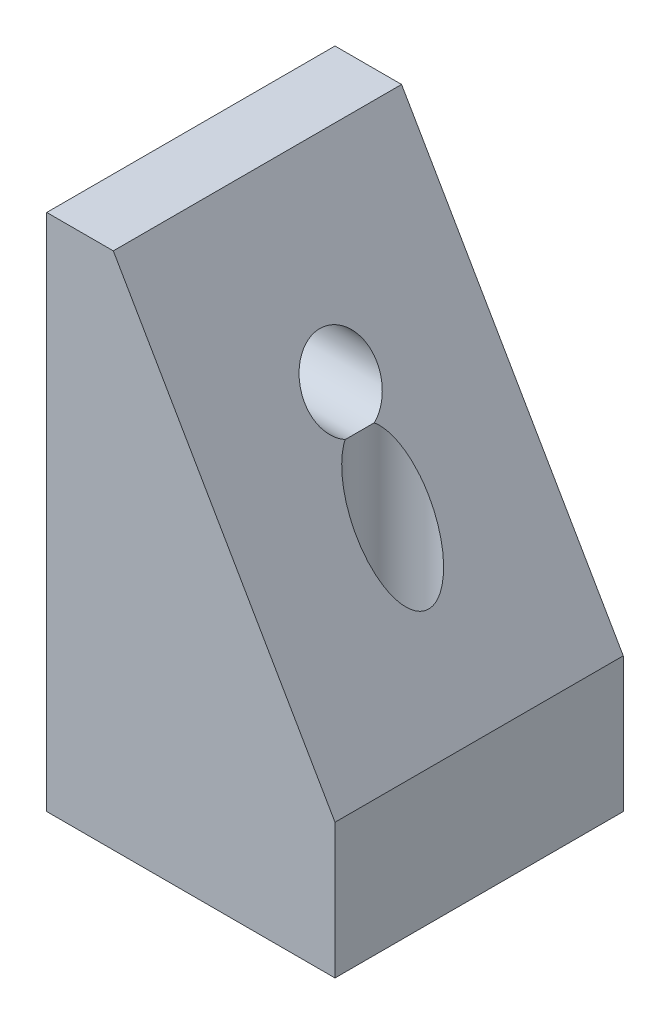
ISO-10303-21;
HEADER;
FILE_DESCRIPTION(('STEP AP214'),'2;1');
FILE_NAME('part.step','',(''),(''),'','','');
FILE_SCHEMA(('AUTOMOTIVE_DESIGN { 1 0 10303 214 1 1 1 1 }'));
ENDSEC;
DATA;
#1=APPLICATION_CONTEXT('core data for automotive mechanical design processes');
#2=APPLICATION_PROTOCOL_DEFINITION('international standard','automotive_design',2000,#1);
#3=PRODUCT_CONTEXT('',#1,'mechanical');
#4=PRODUCT('Part','Part','',(#3));
#5=PRODUCT_RELATED_PRODUCT_CATEGORY('part','',(#4));
#6=PRODUCT_DEFINITION_FORMATION('','',#4);
#7=PRODUCT_DEFINITION_CONTEXT('part definition',#1,'design');
#8=PRODUCT_DEFINITION('design','',#6,#7);
#9=PRODUCT_DEFINITION_SHAPE('','',#8);
#10=(LENGTH_UNIT() NAMED_UNIT(*) SI_UNIT(.MILLI.,.METRE.));
#11=(NAMED_UNIT(*) PLANE_ANGLE_UNIT() SI_UNIT($,.RADIAN.));
#12=(NAMED_UNIT(*) SI_UNIT($,.STERADIAN.) SOLID_ANGLE_UNIT());
#13=UNCERTAINTY_MEASURE_WITH_UNIT(LENGTH_MEASURE(1.E-05),#10,'distance_accuracy_value','');
#14=(GEOMETRIC_REPRESENTATION_CONTEXT(3) GLOBAL_UNCERTAINTY_ASSIGNED_CONTEXT((#13)) GLOBAL_UNIT_ASSIGNED_CONTEXT((#10,
#11,#12)) REPRESENTATION_CONTEXT('',''));
#15=CARTESIAN_POINT('',(0.,0.,0.));
#16=DIRECTION('',(0.,0.,1.));
#17=DIRECTION('',(1.,0.,0.));
#18=AXIS2_PLACEMENT_3D('',#15,#16,#17);
#19=CARTESIAN_POINT('',(0.,0.,10.));
#20=DIRECTION('',(1.,0.,0.));
#21=DIRECTION('',(0.,0.,-1.));
#22=AXIS2_PLACEMENT_3D('',#19,#20,#21);
#23=PLANE('',#22);
#24=DIRECTION('',(0.,-1.,0.));
#25=VECTOR('',#24,1.);
#26=CARTESIAN_POINT('',(0.,0.,0.));
#27=LINE('',#26,#25);
#28=CARTESIAN_POINT('',(0.,18.,0.));
#29=VERTEX_POINT('',#28);
#30=CARTESIAN_POINT('',(0.,0.,0.));
#31=VERTEX_POINT('',#30);
#32=EDGE_CURVE('E77',#29,#31,#27,.T.);
#33=ORIENTED_EDGE('',*,*,#32,.T.);
#34=DIRECTION('',(0.,0.,-1.));
#35=VECTOR('',#34,1.);
#36=CARTESIAN_POINT('',(0.,0.,10.));
#37=LINE('',#36,#35);
#38=CARTESIAN_POINT('',(0.,0.,10.));
#39=VERTEX_POINT('',#38);
#40=EDGE_CURVE('E112',#39,#31,#37,.T.);
#41=ORIENTED_EDGE('',*,*,#40,.F.);
#42=DIRECTION('',(0.,-1.,0.));
#43=VECTOR('',#42,1.);
#44=CARTESIAN_POINT('',(0.,0.,10.));
#45=LINE('',#44,#43);
#46=CARTESIAN_POINT('',(0.,18.,10.));
#47=VERTEX_POINT('',#46);
#48=EDGE_CURVE('E53',#47,#39,#45,.T.);
#49=ORIENTED_EDGE('',*,*,#48,.F.);
#50=DIRECTION('',(0.,0.,-1.));
#51=VECTOR('',#50,1.);
#52=CARTESIAN_POINT('',(0.,18.,10.));
#53=LINE('',#52,#51);
#54=EDGE_CURVE('E108',#47,#29,#53,.T.);
#55=ORIENTED_EDGE('',*,*,#54,.T.);
#56=EDGE_LOOP('',(#33,#41,#49,#55));
#57=FACE_BOUND('',#56,.T.);
#58=CARTESIAN_POINT('',(0.,12.9999999999998,5.));
#59=DIRECTION('',(-1.,0.,0.));
#60=DIRECTION('',(0.,0.,1.));
#61=AXIS2_PLACEMENT_3D('',#58,#59,#60);
#62=CIRCLE('',#61,1.6);
#63=CARTESIAN_POINT('',(0.,12.9999999999998,6.6));
#64=VERTEX_POINT('',#63);
#65=EDGE_CURVE('E144',#64,#64,#62,.T.);
#66=ORIENTED_EDGE('',*,*,#65,.F.);
#67=EDGE_LOOP('',(#66));
#68=FACE_BOUND('',#67,.T.);
#69=ADVANCED_FACE('F31',(#57,#68),#23,.F.);
#70=CARTESIAN_POINT('',(10.,0.,10.));
#71=DIRECTION('',(0.,1.,0.));
#72=DIRECTION('',(-1.,0.,0.));
#73=AXIS2_PLACEMENT_3D('',#70,#71,#72);
#74=PLANE('',#73);
#75=CARTESIAN_POINT('',(7.,0.,5.));
#76=DIRECTION('',(0.,-1.,0.));
#77=DIRECTION('',(0.,0.,-1.));
#78=AXIS2_PLACEMENT_3D('',#75,#76,#77);
#79=CIRCLE('',#78,1.65);
#80=CARTESIAN_POINT('',(7.,0.,3.35));
#81=VERTEX_POINT('',#80);
#82=EDGE_CURVE('E151',#81,#81,#79,.T.);
#83=ORIENTED_EDGE('',*,*,#82,.F.);
#84=EDGE_LOOP('',(#83));
#85=FACE_BOUND('',#84,.T.);
#86=DIRECTION('',(1.,0.,0.));
#87=VECTOR('',#86,1.);
#88=CARTESIAN_POINT('',(10.,0.,0.));
#89=LINE('',#88,#87);
#90=CARTESIAN_POINT('',(10.,0.,0.));
#91=VERTEX_POINT('',#90);
#92=EDGE_CURVE('E116',#31,#91,#89,.T.);
#93=ORIENTED_EDGE('',*,*,#92,.T.);
#94=DIRECTION('',(0.,0.,-1.));
#95=VECTOR('',#94,1.);
#96=CARTESIAN_POINT('',(10.,0.,10.));
#97=LINE('',#96,#95);
#98=CARTESIAN_POINT('',(10.,0.,10.));
#99=VERTEX_POINT('',#98);
#100=EDGE_CURVE('E39',#99,#91,#97,.T.);
#101=ORIENTED_EDGE('',*,*,#100,.F.);
#102=DIRECTION('',(1.,0.,0.));
#103=VECTOR('',#102,1.);
#104=CARTESIAN_POINT('',(10.,0.,10.));
#105=LINE('',#104,#103);
#106=EDGE_CURVE('E126',#39,#99,#105,.T.);
#107=ORIENTED_EDGE('',*,*,#106,.F.);
#108=ORIENTED_EDGE('',*,*,#40,.T.);
#109=EDGE_LOOP('',(#93,#101,#107,#108));
#110=FACE_BOUND('',#109,.T.);
#111=ADVANCED_FACE('F33',(#85,#110),#74,.F.);
#112=CARTESIAN_POINT('',(10.,4.67949192431122,10.));
#113=DIRECTION('',(-1.,0.,0.));
#114=DIRECTION('',(0.,-1.,0.));
#115=AXIS2_PLACEMENT_3D('',#112,#113,#114);
#116=PLANE('',#115);
#117=DIRECTION('',(0.,1.,0.));
#118=VECTOR('',#117,1.);
#119=CARTESIAN_POINT('',(10.,4.67949192431122,0.));
#120=LINE('',#119,#118);
#121=CARTESIAN_POINT('',(10.,4.67949192431122,0.));
#122=VERTEX_POINT('',#121);
#123=EDGE_CURVE('E119',#91,#122,#120,.T.);
#124=ORIENTED_EDGE('',*,*,#123,.T.);
#125=DIRECTION('',(0.,0.,-1.));
#126=VECTOR('',#125,1.);
#127=CARTESIAN_POINT('',(10.,4.67949192431122,10.));
#128=LINE('',#127,#126);
#129=CARTESIAN_POINT('',(10.,4.67949192431122,10.));
#130=VERTEX_POINT('',#129);
#131=EDGE_CURVE('E107',#130,#122,#128,.T.);
#132=ORIENTED_EDGE('',*,*,#131,.F.);
#133=DIRECTION('',(0.,1.,0.));
#134=VECTOR('',#133,1.);
#135=CARTESIAN_POINT('',(10.,4.67949192431122,10.));
#136=LINE('',#135,#134);
#137=EDGE_CURVE('E86',#99,#130,#136,.T.);
#138=ORIENTED_EDGE('',*,*,#137,.F.);
#139=ORIENTED_EDGE('',*,*,#100,.T.);
#140=EDGE_LOOP('',(#124,#132,#138,#139));
#141=FACE_BOUND('',#140,.T.);
#142=ADVANCED_FACE('F130',(#141),#116,.F.);
#143=CARTESIAN_POINT('',(2.3094010767586,18.,10.));
#144=DIRECTION('',(-0.866025403784442,-0.499999999999995,0.));
#145=DIRECTION('',(0.499999999999995,-0.866025403784442,0.));
#146=AXIS2_PLACEMENT_3D('',#143,#144,#145);
#147=PLANE('',#146);
#148=CARTESIAN_POINT('',(5.19615242270679,12.9999999999998,5.));
#149=DIRECTION('',(-0.866025403784442,-0.499999999999995,0.));
#150=DIRECTION('',(-0.499999999999995,0.866025403784442,0.));
#151=AXIS2_PLACEMENT_3D('',#148,#149,#150);
#152=ELLIPSE('',#151,1.44337567297406,1.25);
#153=CARTESIAN_POINT('',(5.85640646055112,11.8564064605509,5.50467198904909));
#154=VERTEX_POINT('',#153);
#155=CARTESIAN_POINT('',(5.85640646055112,11.8564064605509,4.49532801095091));
#156=VERTEX_POINT('',#155);
#157=EDGE_CURVE('E120',#154,#156,#152,.T.);
#158=ORIENTED_EDGE('',*,*,#157,.T.);
#159=CARTESIAN_POINT('',(7.,9.87564434701792,5.));
#160=DIRECTION('',(-0.866025403784442,-0.499999999999995,0.));
#161=DIRECTION('',(0.499999999999995,-0.866025403784442,0.));
#162=AXIS2_PLACEMENT_3D('',#159,#160,#161);
#163=ELLIPSE('',#162,2.50000000000002,1.25);
#164=EDGE_CURVE('E45',#156,#154,#163,.T.);
#165=ORIENTED_EDGE('',*,*,#164,.T.);
#166=EDGE_LOOP('',(#158,#165));
#167=FACE_BOUND('',#166,.T.);
#168=DIRECTION('',(-0.499999999999995,0.866025403784441,0.));
#169=VECTOR('',#168,1.);
#170=CARTESIAN_POINT('',(2.3094010767586,18.,0.));
#171=LINE('',#170,#169);
#172=CARTESIAN_POINT('',(2.3094010767586,18.,0.));
#173=VERTEX_POINT('',#172);
#174=EDGE_CURVE('E104',#122,#173,#171,.T.);
#175=ORIENTED_EDGE('',*,*,#174,.T.);
#176=DIRECTION('',(0.,0.,-1.));
#177=VECTOR('',#176,1.);
#178=CARTESIAN_POINT('',(2.3094010767586,18.,10.));
#179=LINE('',#178,#177);
#180=CARTESIAN_POINT('',(2.3094010767586,18.,10.));
#181=VERTEX_POINT('',#180);
#182=EDGE_CURVE('E101',#181,#173,#179,.T.);
#183=ORIENTED_EDGE('',*,*,#182,.F.);
#184=DIRECTION('',(-0.499999999999995,0.866025403784441,0.));
#185=VECTOR('',#184,1.);
#186=CARTESIAN_POINT('',(2.3094010767586,18.,10.));
#187=LINE('',#186,#185);
#188=EDGE_CURVE('E91',#130,#181,#187,.T.);
#189=ORIENTED_EDGE('',*,*,#188,.F.);
#190=ORIENTED_EDGE('',*,*,#131,.T.);
#191=EDGE_LOOP('',(#175,#183,#189,#190));
#192=FACE_BOUND('',#191,.T.);
#193=ADVANCED_FACE('F102',(#167,#192),#147,.F.);
#194=CARTESIAN_POINT('',(0.,18.,10.));
#195=DIRECTION('',(0.,-1.,0.));
#196=DIRECTION('',(0.,0.,-1.));
#197=AXIS2_PLACEMENT_3D('',#194,#195,#196);
#198=PLANE('',#197);
#199=DIRECTION('',(-1.,0.,0.));
#200=VECTOR('',#199,1.);
#201=CARTESIAN_POINT('',(0.,18.,0.));
#202=LINE('',#201,#200);
#203=EDGE_CURVE('E123',#173,#29,#202,.T.);
#204=ORIENTED_EDGE('',*,*,#203,.T.);
#205=ORIENTED_EDGE('',*,*,#54,.F.);
#206=DIRECTION('',(-1.,0.,0.));
#207=VECTOR('',#206,1.);
#208=CARTESIAN_POINT('',(0.,18.,10.));
#209=LINE('',#208,#207);
#210=EDGE_CURVE('E95',#181,#47,#209,.T.);
#211=ORIENTED_EDGE('',*,*,#210,.F.);
#212=ORIENTED_EDGE('',*,*,#182,.T.);
#213=EDGE_LOOP('',(#204,#205,#211,#212));
#214=FACE_BOUND('',#213,.T.);
#215=ADVANCED_FACE('F110',(#214),#198,.F.);
#216=CARTESIAN_POINT('',(0.,0.,10.));
#217=DIRECTION('',(0.,0.,-1.));
#218=DIRECTION('',(-1.,0.,0.));
#219=AXIS2_PLACEMENT_3D('',#216,#217,#218);
#220=PLANE('',#219);
#221=ORIENTED_EDGE('',*,*,#106,.T.);
#222=ORIENTED_EDGE('',*,*,#137,.T.);
#223=ORIENTED_EDGE('',*,*,#188,.T.);
#224=ORIENTED_EDGE('',*,*,#210,.T.);
#225=ORIENTED_EDGE('',*,*,#48,.T.);
#226=EDGE_LOOP('',(#221,#222,#223,#224,#225));
#227=FACE_BOUND('',#226,.T.);
#228=ADVANCED_FACE('F93',(#227),#220,.F.);
#229=CARTESIAN_POINT('',(0.,0.,0.));
#230=DIRECTION('',(0.,0.,-1.));
#231=DIRECTION('',(-1.,0.,0.));
#232=AXIS2_PLACEMENT_3D('',#229,#230,#231);
#233=PLANE('',#232);
#234=ORIENTED_EDGE('',*,*,#92,.F.);
#235=ORIENTED_EDGE('',*,*,#32,.F.);
#236=ORIENTED_EDGE('',*,*,#203,.F.);
#237=ORIENTED_EDGE('',*,*,#174,.F.);
#238=ORIENTED_EDGE('',*,*,#123,.F.);
#239=EDGE_LOOP('',(#234,#235,#236,#237,#238));
#240=FACE_BOUND('',#239,.T.);
#241=ADVANCED_FACE('F135',(#240),#233,.T.);
#242=CARTESIAN_POINT('',(0.,12.9999999999998,5.));
#243=DIRECTION('',(-1.,0.,0.));
#244=DIRECTION('',(0.,0.,1.));
#245=AXIS2_PLACEMENT_3D('',#242,#243,#244);
#246=CYLINDRICAL_SURFACE('',#245,1.25);
#247=ORIENTED_EDGE('',*,*,#157,.F.);
#248=CARTESIAN_POINT('',(7.,12.9999999999998,5.));
#249=DIRECTION('',(-0.707106781186547,0.707106781186547,0.));
#250=DIRECTION('',(-0.707106781186547,-0.707106781186547,0.));
#251=AXIS2_PLACEMENT_3D('',#248,#249,#250);
#252=ELLIPSE('',#251,1.76776695296637,1.25);
#253=EDGE_CURVE('E11',#154,#156,#252,.F.);
#254=ORIENTED_EDGE('',*,*,#253,.T.);
#255=EDGE_LOOP('',(#247,#254));
#256=FACE_BOUND('',#255,.T.);
#257=CARTESIAN_POINT('',(0.245072638373398,12.9999999999998,5.));
#258=DIRECTION('',(-1.,0.,0.));
#259=DIRECTION('',(0.,0.,1.));
#260=AXIS2_PLACEMENT_3D('',#257,#258,#259);
#261=CIRCLE('',#260,1.25);
#262=CARTESIAN_POINT('',(0.245072638373398,12.9999999999998,6.25));
#263=VERTEX_POINT('',#262);
#264=EDGE_CURVE('E141',#263,#263,#261,.T.);
#265=ORIENTED_EDGE('',*,*,#264,.T.);
#266=EDGE_LOOP('',(#265));
#267=FACE_BOUND('',#266,.T.);
#268=ADVANCED_FACE('F176',(#256,#267),#246,.F.);
#269=CARTESIAN_POINT('',(0.,12.9999999999998,5.));
#270=DIRECTION('',(-1.,0.,0.));
#271=DIRECTION('',(0.,0.,1.));
#272=AXIS2_PLACEMENT_3D('',#269,#270,#271);
#273=CONICAL_SURFACE('',#272,1.6,0.959931088596883);
#274=ORIENTED_EDGE('',*,*,#264,.F.);
#275=EDGE_LOOP('',(#274));
#276=FACE_BOUND('',#275,.T.);
#277=ORIENTED_EDGE('',*,*,#65,.T.);
#278=EDGE_LOOP('',(#277));
#279=FACE_BOUND('',#278,.T.);
#280=ADVANCED_FACE('F180',(#276,#279),#273,.F.);
#281=CARTESIAN_POINT('',(7.,0.,5.));
#282=DIRECTION('',(0.,-1.,0.));
#283=DIRECTION('',(0.,0.,-1.));
#284=AXIS2_PLACEMENT_3D('',#281,#282,#283);
#285=CYLINDRICAL_SURFACE('',#284,1.25);
#286=CARTESIAN_POINT('',(7.,0.280083015283883,5.));
#287=DIRECTION('',(0.,-1.,0.));
#288=DIRECTION('',(0.,0.,-1.));
#289=AXIS2_PLACEMENT_3D('',#286,#287,#288);
#290=CIRCLE('',#289,1.25);
#291=CARTESIAN_POINT('',(7.,0.280083015283883,3.75));
#292=VERTEX_POINT('',#291);
#293=EDGE_CURVE('E148',#292,#292,#290,.T.);
#294=ORIENTED_EDGE('',*,*,#293,.T.);
#295=EDGE_LOOP('',(#294));
#296=FACE_BOUND('',#295,.T.);
#297=ORIENTED_EDGE('',*,*,#253,.F.);
#298=ORIENTED_EDGE('',*,*,#164,.F.);
#299=EDGE_LOOP('',(#297,#298));
#300=FACE_BOUND('',#299,.T.);
#301=ADVANCED_FACE('F178',(#296,#300),#285,.F.);
#302=CARTESIAN_POINT('',(7.,0.,5.));
#303=DIRECTION('',(0.,-1.,0.));
#304=DIRECTION('',(0.,0.,-1.));
#305=AXIS2_PLACEMENT_3D('',#302,#303,#304);
#306=CONICAL_SURFACE('',#305,1.65,0.959931088596887);
#307=ORIENTED_EDGE('',*,*,#293,.F.);
#308=EDGE_LOOP('',(#307));
#309=FACE_BOUND('',#308,.T.);
#310=ORIENTED_EDGE('',*,*,#82,.T.);
#311=EDGE_LOOP('',(#310));
#312=FACE_BOUND('',#311,.T.);
#313=ADVANCED_FACE('F155',(#309,#312),#306,.F.);
#314=CLOSED_SHELL('',(#69,#111,#142,#193,#215,#228,#241,#268,#280,#301,#313));
#315=MANIFOLD_SOLID_BREP('B2',#314);
#316=ADVANCED_BREP_SHAPE_REPRESENTATION('',(#18,#315),#14);
#317=SHAPE_DEFINITION_REPRESENTATION(#9,#316);
ENDSEC;
END-ISO-10303-21;
